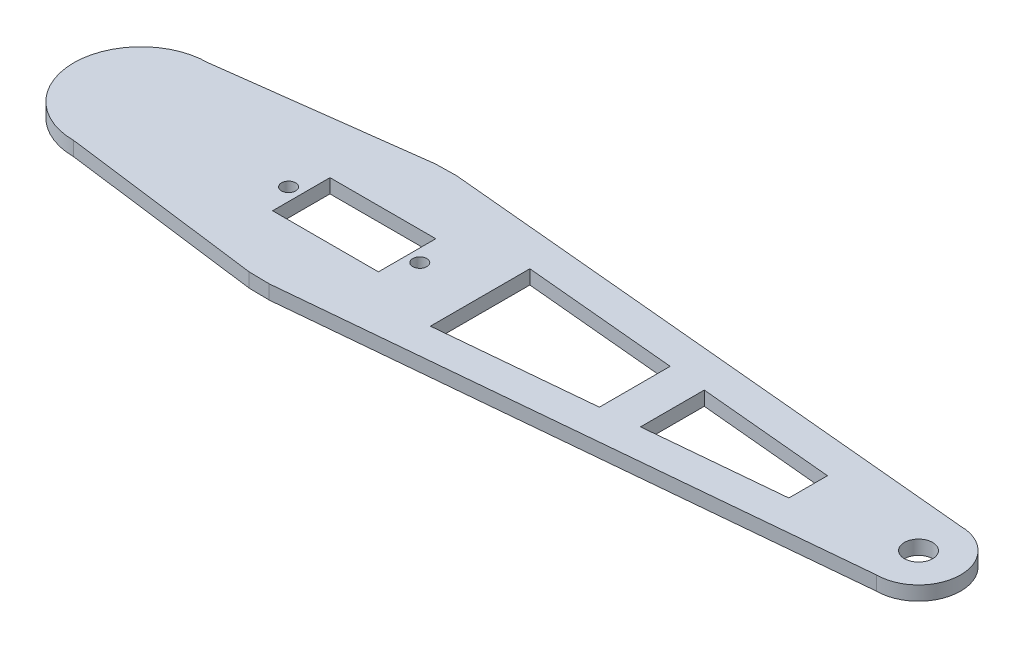
ISO-10303-21;
HEADER;
FILE_DESCRIPTION(('STEP AP214'),'2;1');
FILE_NAME('part.step','',(''),(''),'','','');
FILE_SCHEMA(('AUTOMOTIVE_DESIGN { 1 0 10303 214 1 1 1 1 }'));
ENDSEC;
DATA;
#1=APPLICATION_CONTEXT('core data for automotive mechanical design processes');
#2=APPLICATION_PROTOCOL_DEFINITION('international standard','automotive_design',2000,#1);
#3=PRODUCT_CONTEXT('',#1,'mechanical');
#4=PRODUCT('Part','Part','',(#3));
#5=PRODUCT_RELATED_PRODUCT_CATEGORY('part','',(#4));
#6=PRODUCT_DEFINITION_FORMATION('','',#4);
#7=PRODUCT_DEFINITION_CONTEXT('part definition',#1,'design');
#8=PRODUCT_DEFINITION('design','',#6,#7);
#9=PRODUCT_DEFINITION_SHAPE('','',#8);
#10=(LENGTH_UNIT() NAMED_UNIT(*) SI_UNIT(.MILLI.,.METRE.));
#11=(NAMED_UNIT(*) PLANE_ANGLE_UNIT() SI_UNIT($,.RADIAN.));
#12=(NAMED_UNIT(*) SI_UNIT($,.STERADIAN.) SOLID_ANGLE_UNIT());
#13=UNCERTAINTY_MEASURE_WITH_UNIT(LENGTH_MEASURE(1.E-05),#10,'distance_accuracy_value','');
#14=(GEOMETRIC_REPRESENTATION_CONTEXT(3) GLOBAL_UNCERTAINTY_ASSIGNED_CONTEXT((#13)) GLOBAL_UNIT_ASSIGNED_CONTEXT((#10,
#11,#12)) REPRESENTATION_CONTEXT('',''));
#15=CARTESIAN_POINT('',(0.,0.,0.));
#16=DIRECTION('',(0.,0.,1.));
#17=DIRECTION('',(1.,0.,0.));
#18=AXIS2_PLACEMENT_3D('',#15,#16,#17);
#19=CARTESIAN_POINT('',(120.,3.,0.));
#20=DIRECTION('',(0.,-1.,0.));
#21=DIRECTION('',(0.,0.,-1.));
#22=AXIS2_PLACEMENT_3D('',#19,#20,#21);
#23=PLANE('',#22);
#24=CARTESIAN_POINT('',(-13.95,3.,0.));
#25=DIRECTION('',(0.,1.,0.));
#26=DIRECTION('',(0.,0.,1.));
#27=AXIS2_PLACEMENT_3D('',#24,#25,#26);
#28=CIRCLE('',#27,1.5);
#29=CARTESIAN_POINT('',(-13.95,3.,1.5));
#30=VERTEX_POINT('',#29);
#31=EDGE_CURVE('E213',#30,#30,#28,.T.);
#32=ORIENTED_EDGE('',*,*,#31,.F.);
#33=EDGE_LOOP('',(#32));
#34=FACE_BOUND('',#33,.T.);
#35=CARTESIAN_POINT('',(13.95,3.,0.));
#36=DIRECTION('',(0.,1.,0.));
#37=DIRECTION('',(0.,0.,1.));
#38=AXIS2_PLACEMENT_3D('',#35,#36,#37);
#39=CIRCLE('',#38,1.5);
#40=CARTESIAN_POINT('',(13.95,3.,1.5));
#41=VERTEX_POINT('',#40);
#42=EDGE_CURVE('E219',#41,#41,#39,.T.);
#43=ORIENTED_EDGE('',*,*,#42,.F.);
#44=EDGE_LOOP('',(#43));
#45=FACE_BOUND('',#44,.T.);
#46=DIRECTION('',(0.,0.,-1.));
#47=VECTOR('',#46,1.);
#48=CARTESIAN_POINT('',(96.5291672845656,3.,-4.10426717337135));
#49=LINE('',#48,#47);
#50=CARTESIAN_POINT('',(96.5291672845656,3.,4.10426717337135));
#51=VERTEX_POINT('',#50);
#52=CARTESIAN_POINT('',(96.5291672845656,3.,-4.10426717337135));
#53=VERTEX_POINT('',#52);
#54=EDGE_CURVE('E225',#51,#53,#49,.T.);
#55=ORIENTED_EDGE('',*,*,#54,.F.);
#56=DIRECTION('',(0.9957277620175,0.,-0.0923375543731872));
#57=VECTOR('',#56,1.);
#58=CARTESIAN_POINT('',(96.5291672845656,3.,4.10426717337135));
#59=LINE('',#58,#57);
#60=CARTESIAN_POINT('',(67.6603473994946,3.,6.78138066514184));
#61=VERTEX_POINT('',#60);
#62=EDGE_CURVE('E233',#61,#51,#59,.T.);
#63=ORIENTED_EDGE('',*,*,#62,.F.);
#64=DIRECTION('',(0.,0.,1.));
#65=VECTOR('',#64,1.);
#66=CARTESIAN_POINT('',(67.6603473994946,3.,-6.78138066514184));
#67=LINE('',#66,#65);
#68=CARTESIAN_POINT('',(67.6603473994946,3.,-6.78138066514184));
#69=VERTEX_POINT('',#68);
#70=EDGE_CURVE('E230',#69,#61,#67,.T.);
#71=ORIENTED_EDGE('',*,*,#70,.F.);
#72=DIRECTION('',(-0.9957277620175,0.,-0.092337554373187));
#73=VECTOR('',#72,1.);
#74=CARTESIAN_POINT('',(96.5291672845656,3.,-4.10426717337135));
#75=LINE('',#74,#73);
#76=EDGE_CURVE('E227',#53,#69,#75,.T.);
#77=ORIENTED_EDGE('',*,*,#76,.F.);
#78=EDGE_LOOP('',(#55,#63,#71,#77));
#79=FACE_BOUND('',#78,.T.);
#80=DIRECTION('',(-0.999836383133335,0.,0.018088862950765));
#81=VECTOR('',#80,1.);
#82=CARTESIAN_POINT('',(-2.56588798882,3.,-19.834722554874));
#83=LINE('',#82,#81);
#84=CARTESIAN_POINT('',(1.84675108746374,3.,-19.91455524035));
#85=VERTEX_POINT('',#84);
#86=CARTESIAN_POINT('',(-2.56588798882,3.,-19.834722554874));
#87=VERTEX_POINT('',#86);
#88=EDGE_CURVE('E287',#85,#87,#83,.T.);
#89=ORIENTED_EDGE('',*,*,#88,.T.);
#90=DIRECTION('',(-0.991736127743702,0.,0.128294399441));
#91=VECTOR('',#90,1.);
#92=CARTESIAN_POINT('',(-45.3434905183184,3.,-14.3008646338827));
#93=LINE('',#92,#91);
#94=CARTESIAN_POINT('',(-45.3434905183184,3.,-14.3008646338827));
#95=VERTEX_POINT('',#94);
#96=EDGE_CURVE('E290',#87,#95,#93,.T.);
#97=ORIENTED_EDGE('',*,*,#96,.T.);
#98=CARTESIAN_POINT('',(-45.3434905183184,3.,0.));
#99=DIRECTION('',(0.,1.,0.));
#100=DIRECTION('',(0.,0.,1.));
#101=AXIS2_PLACEMENT_3D('',#98,#99,#100);
#102=CIRCLE('',#101,14.3008646338827);
#103=CARTESIAN_POINT('',(-45.3434905183184,3.,14.3008646338827));
#104=VERTEX_POINT('',#103);
#105=EDGE_CURVE('E293',#95,#104,#102,.T.);
#106=ORIENTED_EDGE('',*,*,#105,.T.);
#107=DIRECTION('',(0.991736127743702,0.,0.128294399441));
#108=VECTOR('',#107,1.);
#109=CARTESIAN_POINT('',(-45.3434905183184,3.,14.3008646338827));
#110=LINE('',#109,#108);
#111=CARTESIAN_POINT('',(-2.56588798882,3.,19.834722554874));
#112=VERTEX_POINT('',#111);
#113=EDGE_CURVE('E295',#104,#112,#110,.T.);
#114=ORIENTED_EDGE('',*,*,#113,.T.);
#115=DIRECTION('',(0.999836383133335,0.,0.0180888629507665));
#116=VECTOR('',#115,1.);
#117=CARTESIAN_POINT('',(-2.56588798882,3.,19.834722554874));
#118=LINE('',#117,#116);
#119=CARTESIAN_POINT('',(1.84675108746374,3.,19.91455524035));
#120=VERTEX_POINT('',#119);
#121=EDGE_CURVE('E297',#112,#120,#118,.T.);
#122=ORIENTED_EDGE('',*,*,#121,.T.);
#123=DIRECTION('',(0.9957277620175,0.,-0.0923375543731872));
#124=VECTOR('',#123,1.);
#125=CARTESIAN_POINT('',(120.,3.,8.95776317127611));
#126=LINE('',#125,#124);
#127=CARTESIAN_POINT('',(120.,3.,8.95776317127611));
#128=VERTEX_POINT('',#127);
#129=EDGE_CURVE('E299',#120,#128,#126,.T.);
#130=ORIENTED_EDGE('',*,*,#129,.T.);
#131=CARTESIAN_POINT('',(120.,3.,0.));
#132=DIRECTION('',(0.,1.,0.));
#133=DIRECTION('',(0.,0.,-1.));
#134=AXIS2_PLACEMENT_3D('',#131,#132,#133);
#135=CIRCLE('',#134,8.95776317127611);
#136=CARTESIAN_POINT('',(120.,3.,-8.95776317127611));
#137=VERTEX_POINT('',#136);
#138=EDGE_CURVE('E301',#128,#137,#135,.T.);
#139=ORIENTED_EDGE('',*,*,#138,.T.);
#140=DIRECTION('',(-0.9957277620175,0.,-0.0923375543731871));
#141=VECTOR('',#140,1.);
#142=CARTESIAN_POINT('',(1.84675108746374,3.,-19.91455524035));
#143=LINE('',#142,#141);
#144=EDGE_CURVE('E303',#137,#85,#143,.T.);
#145=ORIENTED_EDGE('',*,*,#144,.T.);
#146=EDGE_LOOP('',(#89,#97,#106,#114,#122,#130,#139,#145));
#147=FACE_BOUND('',#146,.T.);
#148=DIRECTION('',(0.,0.,-1.));
#149=VECTOR('',#148,1.);
#150=CARTESIAN_POINT('',(11.25,3.,-6.1));
#151=LINE('',#150,#149);
#152=CARTESIAN_POINT('',(11.25,3.,6.1));
#153=VERTEX_POINT('',#152);
#154=CARTESIAN_POINT('',(11.25,3.,-6.1));
#155=VERTEX_POINT('',#154);
#156=EDGE_CURVE('E256',#153,#155,#151,.T.);
#157=ORIENTED_EDGE('',*,*,#156,.F.);
#158=DIRECTION('',(1.,0.,0.));
#159=VECTOR('',#158,1.);
#160=CARTESIAN_POINT('',(-11.25,3.,6.1));
#161=LINE('',#160,#159);
#162=CARTESIAN_POINT('',(-11.25,3.,6.1));
#163=VERTEX_POINT('',#162);
#164=EDGE_CURVE('E264',#163,#153,#161,.T.);
#165=ORIENTED_EDGE('',*,*,#164,.F.);
#166=DIRECTION('',(0.,0.,1.));
#167=VECTOR('',#166,1.);
#168=CARTESIAN_POINT('',(-11.25,3.,-6.1));
#169=LINE('',#168,#167);
#170=CARTESIAN_POINT('',(-11.25,3.,-6.1));
#171=VERTEX_POINT('',#170);
#172=EDGE_CURVE('E261',#171,#163,#169,.T.);
#173=ORIENTED_EDGE('',*,*,#172,.F.);
#174=DIRECTION('',(-1.,0.,0.));
#175=VECTOR('',#174,1.);
#176=CARTESIAN_POINT('',(-11.25,3.,-6.1));
#177=LINE('',#176,#175);
#178=EDGE_CURVE('E258',#155,#171,#177,.T.);
#179=ORIENTED_EDGE('',*,*,#178,.F.);
#180=EDGE_LOOP('',(#157,#165,#173,#179));
#181=FACE_BOUND('',#180,.T.);
#182=DIRECTION('',(0.,0.,-1.));
#183=VECTOR('',#182,1.);
#184=CARTESIAN_POINT('',(59.6591330402502,3.,7.52336315687362));
#185=LINE('',#184,#183);
#186=CARTESIAN_POINT('',(59.6591330402502,3.,7.52336315687362));
#187=VERTEX_POINT('',#186);
#188=CARTESIAN_POINT('',(59.6591330402502,3.,-7.52336315687363));
#189=VERTEX_POINT('',#188);
#190=EDGE_CURVE('E174',#187,#189,#185,.T.);
#191=ORIENTED_EDGE('',*,*,#190,.F.);
#192=DIRECTION('',(0.9957277620175,0.,-0.0923375543731874));
#193=VECTOR('',#192,1.);
#194=CARTESIAN_POINT('',(26.7796007232022,3.,10.5724049923036));
#195=LINE('',#194,#193);
#196=CARTESIAN_POINT('',(26.7796007232022,3.,10.5724049923036));
#197=VERTEX_POINT('',#196);
#198=EDGE_CURVE('E197',#197,#187,#195,.T.);
#199=ORIENTED_EDGE('',*,*,#198,.F.);
#200=DIRECTION('',(0.,0.,1.));
#201=VECTOR('',#200,1.);
#202=CARTESIAN_POINT('',(26.7796007232022,3.,-10.5724049923036));
#203=LINE('',#202,#201);
#204=CARTESIAN_POINT('',(26.7796007232022,3.,-10.5724049923036));
#205=VERTEX_POINT('',#204);
#206=EDGE_CURVE('E195',#205,#197,#203,.T.);
#207=ORIENTED_EDGE('',*,*,#206,.F.);
#208=DIRECTION('',(-0.9957277620175,0.,-0.092337554373187));
#209=VECTOR('',#208,1.);
#210=CARTESIAN_POINT('',(59.6591330402502,3.,-7.52336315687363));
#211=LINE('',#210,#209);
#212=EDGE_CURVE('E182',#189,#205,#211,.T.);
#213=ORIENTED_EDGE('',*,*,#212,.F.);
#214=EDGE_LOOP('',(#191,#199,#207,#213));
#215=FACE_BOUND('',#214,.T.);
#216=CARTESIAN_POINT('',(120.,3.,0.));
#217=DIRECTION('',(0.,1.,0.));
#218=DIRECTION('',(0.,0.,1.));
#219=AXIS2_PLACEMENT_3D('',#216,#217,#218);
#220=CIRCLE('',#219,3.00000000000001);
#221=CARTESIAN_POINT('',(120.,3.,3.00000000000001));
#222=VERTEX_POINT('',#221);
#223=EDGE_CURVE('E203',#222,#222,#220,.T.);
#224=ORIENTED_EDGE('',*,*,#223,.F.);
#225=EDGE_LOOP('',(#224));
#226=FACE_BOUND('',#225,.T.);
#227=ADVANCED_FACE('F37',(#34,#45,#79,#147,#181,#215,#226),#23,.F.);
#228=CARTESIAN_POINT('',(120.,0.,0.));
#229=DIRECTION('',(0.,-1.,0.));
#230=DIRECTION('',(0.,0.,-1.));
#231=AXIS2_PLACEMENT_3D('',#228,#229,#230);
#232=PLANE('',#231);
#233=DIRECTION('',(0.9957277620175,0.,-0.0923375543731874));
#234=VECTOR('',#233,1.);
#235=CARTESIAN_POINT('',(26.7796007232022,0.,10.5724049923036));
#236=LINE('',#235,#234);
#237=CARTESIAN_POINT('',(26.7796007232022,0.,10.5724049923036));
#238=VERTEX_POINT('',#237);
#239=CARTESIAN_POINT('',(59.6591330402502,0.,7.52336315687362));
#240=VERTEX_POINT('',#239);
#241=EDGE_CURVE('E183',#238,#240,#236,.T.);
#242=ORIENTED_EDGE('',*,*,#241,.T.);
#243=DIRECTION('',(0.,0.,-1.));
#244=VECTOR('',#243,1.);
#245=CARTESIAN_POINT('',(59.6591330402502,0.,7.52336315687362));
#246=LINE('',#245,#244);
#247=CARTESIAN_POINT('',(59.6591330402502,0.,-7.52336315687363));
#248=VERTEX_POINT('',#247);
#249=EDGE_CURVE('E60',#240,#248,#246,.T.);
#250=ORIENTED_EDGE('',*,*,#249,.T.);
#251=DIRECTION('',(-0.9957277620175,0.,-0.092337554373187));
#252=VECTOR('',#251,1.);
#253=CARTESIAN_POINT('',(59.6591330402502,0.,-7.52336315687363));
#254=LINE('',#253,#252);
#255=CARTESIAN_POINT('',(26.7796007232022,0.,-10.5724049923036));
#256=VERTEX_POINT('',#255);
#257=EDGE_CURVE('E189',#248,#256,#254,.T.);
#258=ORIENTED_EDGE('',*,*,#257,.T.);
#259=DIRECTION('',(0.,0.,1.));
#260=VECTOR('',#259,1.);
#261=CARTESIAN_POINT('',(26.7796007232022,0.,-10.5724049923036));
#262=LINE('',#261,#260);
#263=EDGE_CURVE('E205',#256,#238,#262,.T.);
#264=ORIENTED_EDGE('',*,*,#263,.T.);
#265=EDGE_LOOP('',(#242,#250,#258,#264));
#266=FACE_BOUND('',#265,.T.);
#267=CARTESIAN_POINT('',(-13.95,0.,0.));
#268=DIRECTION('',(0.,1.,0.));
#269=DIRECTION('',(0.,0.,1.));
#270=AXIS2_PLACEMENT_3D('',#267,#268,#269);
#271=CIRCLE('',#270,1.5);
#272=CARTESIAN_POINT('',(-13.95,0.,1.5));
#273=VERTEX_POINT('',#272);
#274=EDGE_CURVE('E190',#273,#273,#271,.T.);
#275=ORIENTED_EDGE('',*,*,#274,.T.);
#276=EDGE_LOOP('',(#275));
#277=FACE_BOUND('',#276,.T.);
#278=DIRECTION('',(0.9957277620175,0.,-0.0923375543731872));
#279=VECTOR('',#278,1.);
#280=CARTESIAN_POINT('',(96.5291672845656,0.,4.10426717337135));
#281=LINE('',#280,#279);
#282=CARTESIAN_POINT('',(67.6603473994946,0.,6.78138066514184));
#283=VERTEX_POINT('',#282);
#284=CARTESIAN_POINT('',(96.5291672845656,0.,4.10426717337134));
#285=VERTEX_POINT('',#284);
#286=EDGE_CURVE('E228',#283,#285,#281,.T.);
#287=ORIENTED_EDGE('',*,*,#286,.T.);
#288=DIRECTION('',(0.,0.,-1.));
#289=VECTOR('',#288,1.);
#290=CARTESIAN_POINT('',(96.5291672845656,0.,-4.10426717337135));
#291=LINE('',#290,#289);
#292=CARTESIAN_POINT('',(96.5291672845656,0.,-4.10426717337135));
#293=VERTEX_POINT('',#292);
#294=EDGE_CURVE('E222',#285,#293,#291,.T.);
#295=ORIENTED_EDGE('',*,*,#294,.T.);
#296=DIRECTION('',(-0.9957277620175,0.,-0.092337554373187));
#297=VECTOR('',#296,1.);
#298=CARTESIAN_POINT('',(96.5291672845656,0.,-4.10426717337135));
#299=LINE('',#298,#297);
#300=CARTESIAN_POINT('',(67.6603473994946,0.,-6.78138066514184));
#301=VERTEX_POINT('',#300);
#302=EDGE_CURVE('E238',#293,#301,#299,.T.);
#303=ORIENTED_EDGE('',*,*,#302,.T.);
#304=DIRECTION('',(0.,0.,1.));
#305=VECTOR('',#304,1.);
#306=CARTESIAN_POINT('',(67.6603473994946,0.,-6.78138066514184));
#307=LINE('',#306,#305);
#308=EDGE_CURVE('E241',#301,#283,#307,.T.);
#309=ORIENTED_EDGE('',*,*,#308,.T.);
#310=EDGE_LOOP('',(#287,#295,#303,#309));
#311=FACE_BOUND('',#310,.T.);
#312=DIRECTION('',(1.,0.,0.));
#313=VECTOR('',#312,1.);
#314=CARTESIAN_POINT('',(-11.25,0.,6.1));
#315=LINE('',#314,#313);
#316=CARTESIAN_POINT('',(-11.25,0.,6.1));
#317=VERTEX_POINT('',#316);
#318=CARTESIAN_POINT('',(11.25,0.,6.1));
#319=VERTEX_POINT('',#318);
#320=EDGE_CURVE('E259',#317,#319,#315,.T.);
#321=ORIENTED_EDGE('',*,*,#320,.T.);
#322=DIRECTION('',(0.,0.,-1.));
#323=VECTOR('',#322,1.);
#324=CARTESIAN_POINT('',(11.25,0.,-6.1));
#325=LINE('',#324,#323);
#326=CARTESIAN_POINT('',(11.25,0.,-6.1));
#327=VERTEX_POINT('',#326);
#328=EDGE_CURVE('E255',#319,#327,#325,.T.);
#329=ORIENTED_EDGE('',*,*,#328,.T.);
#330=DIRECTION('',(-1.,0.,0.));
#331=VECTOR('',#330,1.);
#332=CARTESIAN_POINT('',(-11.25,0.,-6.1));
#333=LINE('',#332,#331);
#334=CARTESIAN_POINT('',(-11.25,0.,-6.1));
#335=VERTEX_POINT('',#334);
#336=EDGE_CURVE('E269',#327,#335,#333,.T.);
#337=ORIENTED_EDGE('',*,*,#336,.T.);
#338=DIRECTION('',(0.,0.,1.));
#339=VECTOR('',#338,1.);
#340=CARTESIAN_POINT('',(-11.25,0.,-6.1));
#341=LINE('',#340,#339);
#342=EDGE_CURVE('E272',#335,#317,#341,.T.);
#343=ORIENTED_EDGE('',*,*,#342,.T.);
#344=EDGE_LOOP('',(#321,#329,#337,#343));
#345=FACE_BOUND('',#344,.T.);
#346=DIRECTION('',(-0.999836383133335,0.,0.018088862950765));
#347=VECTOR('',#346,1.);
#348=CARTESIAN_POINT('',(-2.56588798882,0.,-19.834722554874));
#349=LINE('',#348,#347);
#350=CARTESIAN_POINT('',(1.84675108746374,0.,-19.91455524035));
#351=VERTEX_POINT('',#350);
#352=CARTESIAN_POINT('',(-2.56588798882,0.,-19.834722554874));
#353=VERTEX_POINT('',#352);
#354=EDGE_CURVE('E286',#351,#353,#349,.T.);
#355=ORIENTED_EDGE('',*,*,#354,.F.);
#356=DIRECTION('',(-0.9957277620175,0.,-0.0923375543731871));
#357=VECTOR('',#356,1.);
#358=CARTESIAN_POINT('',(1.84675108746374,0.,-19.91455524035));
#359=LINE('',#358,#357);
#360=CARTESIAN_POINT('',(120.,0.,-8.95776317127611));
#361=VERTEX_POINT('',#360);
#362=EDGE_CURVE('E291',#361,#351,#359,.T.);
#363=ORIENTED_EDGE('',*,*,#362,.F.);
#364=CARTESIAN_POINT('',(120.,0.,0.));
#365=DIRECTION('',(0.,1.,0.));
#366=DIRECTION('',(0.,0.,-1.));
#367=AXIS2_PLACEMENT_3D('',#364,#365,#366);
#368=CIRCLE('',#367,8.95776317127611);
#369=CARTESIAN_POINT('',(120.,0.,8.95776317127611));
#370=VERTEX_POINT('',#369);
#371=EDGE_CURVE('E318',#370,#361,#368,.T.);
#372=ORIENTED_EDGE('',*,*,#371,.F.);
#373=DIRECTION('',(0.9957277620175,0.,-0.0923375543731872));
#374=VECTOR('',#373,1.);
#375=CARTESIAN_POINT('',(120.,0.,8.95776317127611));
#376=LINE('',#375,#374);
#377=CARTESIAN_POINT('',(1.84675108746374,0.,19.91455524035));
#378=VERTEX_POINT('',#377);
#379=EDGE_CURVE('E316',#378,#370,#376,.T.);
#380=ORIENTED_EDGE('',*,*,#379,.F.);
#381=DIRECTION('',(0.999836383133335,0.,0.0180888629507665));
#382=VECTOR('',#381,1.);
#383=CARTESIAN_POINT('',(-2.56588798882,0.,19.834722554874));
#384=LINE('',#383,#382);
#385=CARTESIAN_POINT('',(-2.56588798882,0.,19.834722554874));
#386=VERTEX_POINT('',#385);
#387=EDGE_CURVE('E314',#386,#378,#384,.T.);
#388=ORIENTED_EDGE('',*,*,#387,.F.);
#389=DIRECTION('',(0.991736127743702,0.,0.128294399441));
#390=VECTOR('',#389,1.);
#391=CARTESIAN_POINT('',(-45.3434905183184,0.,14.3008646338827));
#392=LINE('',#391,#390);
#393=CARTESIAN_POINT('',(-45.3434905183184,0.,14.3008646338827));
#394=VERTEX_POINT('',#393);
#395=EDGE_CURVE('E312',#394,#386,#392,.T.);
#396=ORIENTED_EDGE('',*,*,#395,.F.);
#397=CARTESIAN_POINT('',(-45.3434905183184,0.,0.));
#398=DIRECTION('',(0.,1.,0.));
#399=DIRECTION('',(0.,0.,1.));
#400=AXIS2_PLACEMENT_3D('',#397,#398,#399);
#401=CIRCLE('',#400,14.3008646338827);
#402=CARTESIAN_POINT('',(-45.3434905183184,0.,-14.3008646338827));
#403=VERTEX_POINT('',#402);
#404=EDGE_CURVE('E310',#403,#394,#401,.T.);
#405=ORIENTED_EDGE('',*,*,#404,.F.);
#406=DIRECTION('',(-0.991736127743702,0.,0.128294399441));
#407=VECTOR('',#406,1.);
#408=CARTESIAN_POINT('',(-45.3434905183184,0.,-14.3008646338827));
#409=LINE('',#408,#407);
#410=EDGE_CURVE('E308',#353,#403,#409,.T.);
#411=ORIENTED_EDGE('',*,*,#410,.F.);
#412=EDGE_LOOP('',(#355,#363,#372,#380,#388,#396,#405,#411));
#413=FACE_BOUND('',#412,.T.);
#414=CARTESIAN_POINT('',(13.95,0.,0.));
#415=DIRECTION('',(0.,1.,0.));
#416=DIRECTION('',(0.,0.,1.));
#417=AXIS2_PLACEMENT_3D('',#414,#415,#416);
#418=CIRCLE('',#417,1.5);
#419=CARTESIAN_POINT('',(13.95,0.,1.5));
#420=VERTEX_POINT('',#419);
#421=EDGE_CURVE('E216',#420,#420,#418,.T.);
#422=ORIENTED_EDGE('',*,*,#421,.T.);
#423=EDGE_LOOP('',(#422));
#424=FACE_BOUND('',#423,.T.);
#425=CARTESIAN_POINT('',(120.,0.,0.));
#426=DIRECTION('',(0.,1.,0.));
#427=DIRECTION('',(0.,0.,1.));
#428=AXIS2_PLACEMENT_3D('',#425,#426,#427);
#429=CIRCLE('',#428,3.00000000000001);
#430=CARTESIAN_POINT('',(120.,0.,3.00000000000001));
#431=VERTEX_POINT('',#430);
#432=EDGE_CURVE('E478',#431,#431,#429,.T.);
#433=ORIENTED_EDGE('',*,*,#432,.T.);
#434=EDGE_LOOP('',(#433));
#435=FACE_BOUND('',#434,.T.);
#436=ADVANCED_FACE('F348',(#266,#277,#311,#345,#413,#424,#435),#232,.T.);
#437=CARTESIAN_POINT('',(-2.56588798882,3.,-19.834722554874));
#438=DIRECTION('',(0.018088862950765,0.,0.999836383133335));
#439=DIRECTION('',(0.999836383133335,0.,-0.018088862950765));
#440=AXIS2_PLACEMENT_3D('',#437,#438,#439);
#441=PLANE('',#440);
#442=ORIENTED_EDGE('',*,*,#354,.T.);
#443=DIRECTION('',(0.,-1.,0.));
#444=VECTOR('',#443,1.);
#445=CARTESIAN_POINT('',(-2.56588798882,3.,-19.834722554874));
#446=LINE('',#445,#444);
#447=EDGE_CURVE('E11',#87,#353,#446,.T.);
#448=ORIENTED_EDGE('',*,*,#447,.F.);
#449=ORIENTED_EDGE('',*,*,#88,.F.);
#450=DIRECTION('',(0.,-1.,0.));
#451=VECTOR('',#450,1.);
#452=CARTESIAN_POINT('',(1.84675108746374,3.,-19.91455524035));
#453=LINE('',#452,#451);
#454=EDGE_CURVE('E305',#85,#351,#453,.T.);
#455=ORIENTED_EDGE('',*,*,#454,.T.);
#456=EDGE_LOOP('',(#442,#448,#449,#455));
#457=FACE_BOUND('',#456,.T.);
#458=ADVANCED_FACE('F39',(#457),#441,.F.);
#459=CARTESIAN_POINT('',(-45.3434905183184,3.,-14.3008646338827));
#460=DIRECTION('',(0.128294399441,0.,0.991736127743702));
#461=DIRECTION('',(0.991736127743702,0.,-0.128294399441));
#462=AXIS2_PLACEMENT_3D('',#459,#460,#461);
#463=PLANE('',#462);
#464=ORIENTED_EDGE('',*,*,#410,.T.);
#465=DIRECTION('',(0.,-1.,0.));
#466=VECTOR('',#465,1.);
#467=CARTESIAN_POINT('',(-45.3434905183184,3.,-14.3008646338827));
#468=LINE('',#467,#466);
#469=EDGE_CURVE('E45',#95,#403,#468,.T.);
#470=ORIENTED_EDGE('',*,*,#469,.F.);
#471=ORIENTED_EDGE('',*,*,#96,.F.);
#472=ORIENTED_EDGE('',*,*,#447,.T.);
#473=EDGE_LOOP('',(#464,#470,#471,#472));
#474=FACE_BOUND('',#473,.T.);
#475=ADVANCED_FACE('F366',(#474),#463,.F.);
#476=CARTESIAN_POINT('',(-45.3434905183184,3.,0.));
#477=DIRECTION('',(0.,-1.,0.));
#478=DIRECTION('',(0.,0.,-1.));
#479=AXIS2_PLACEMENT_3D('',#476,#477,#478);
#480=CYLINDRICAL_SURFACE('',#479,14.3008646338827);
#481=ORIENTED_EDGE('',*,*,#404,.T.);
#482=DIRECTION('',(0.,-1.,0.));
#483=VECTOR('',#482,1.);
#484=CARTESIAN_POINT('',(-45.3434905183184,3.,14.3008646338827));
#485=LINE('',#484,#483);
#486=EDGE_CURVE('E335',#104,#394,#485,.T.);
#487=ORIENTED_EDGE('',*,*,#486,.F.);
#488=ORIENTED_EDGE('',*,*,#105,.F.);
#489=ORIENTED_EDGE('',*,*,#469,.T.);
#490=EDGE_LOOP('',(#481,#487,#488,#489));
#491=FACE_BOUND('',#490,.T.);
#492=ADVANCED_FACE('F342',(#491),#480,.T.);
#493=CARTESIAN_POINT('',(-45.3434905183184,3.,14.3008646338827));
#494=DIRECTION('',(0.128294399441,0.,-0.991736127743702));
#495=DIRECTION('',(-0.991736127743702,0.,-0.128294399441));
#496=AXIS2_PLACEMENT_3D('',#493,#494,#495);
#497=PLANE('',#496);
#498=ORIENTED_EDGE('',*,*,#395,.T.);
#499=DIRECTION('',(0.,-1.,0.));
#500=VECTOR('',#499,1.);
#501=CARTESIAN_POINT('',(-2.56588798882,3.,19.834722554874));
#502=LINE('',#501,#500);
#503=EDGE_CURVE('E332',#112,#386,#502,.T.);
#504=ORIENTED_EDGE('',*,*,#503,.F.);
#505=ORIENTED_EDGE('',*,*,#113,.F.);
#506=ORIENTED_EDGE('',*,*,#486,.T.);
#507=EDGE_LOOP('',(#498,#504,#505,#506));
#508=FACE_BOUND('',#507,.T.);
#509=ADVANCED_FACE('F354',(#508),#497,.F.);
#510=CARTESIAN_POINT('',(-2.56588798882,3.,19.834722554874));
#511=DIRECTION('',(0.0180888629507665,0.,-0.999836383133335));
#512=DIRECTION('',(-0.999836383133335,0.,-0.0180888629507665));
#513=AXIS2_PLACEMENT_3D('',#510,#511,#512);
#514=PLANE('',#513);
#515=ORIENTED_EDGE('',*,*,#387,.T.);
#516=DIRECTION('',(0.,-1.,0.));
#517=VECTOR('',#516,1.);
#518=CARTESIAN_POINT('',(1.84675108746374,3.,19.91455524035));
#519=LINE('',#518,#517);
#520=EDGE_CURVE('E329',#120,#378,#519,.T.);
#521=ORIENTED_EDGE('',*,*,#520,.F.);
#522=ORIENTED_EDGE('',*,*,#121,.F.);
#523=ORIENTED_EDGE('',*,*,#503,.T.);
#524=EDGE_LOOP('',(#515,#521,#522,#523));
#525=FACE_BOUND('',#524,.T.);
#526=ADVANCED_FACE('F358',(#525),#514,.F.);
#527=CARTESIAN_POINT('',(120.,3.,8.95776317127611));
#528=DIRECTION('',(-0.0923375543731872,0.,-0.9957277620175));
#529=DIRECTION('',(-0.9957277620175,0.,0.0923375543731872));
#530=AXIS2_PLACEMENT_3D('',#527,#528,#529);
#531=PLANE('',#530);
#532=ORIENTED_EDGE('',*,*,#379,.T.);
#533=DIRECTION('',(0.,-1.,0.));
#534=VECTOR('',#533,1.);
#535=CARTESIAN_POINT('',(120.,3.,8.95776317127611));
#536=LINE('',#535,#534);
#537=EDGE_CURVE('E326',#128,#370,#536,.T.);
#538=ORIENTED_EDGE('',*,*,#537,.F.);
#539=ORIENTED_EDGE('',*,*,#129,.F.);
#540=ORIENTED_EDGE('',*,*,#520,.T.);
#541=EDGE_LOOP('',(#532,#538,#539,#540));
#542=FACE_BOUND('',#541,.T.);
#543=ADVANCED_FACE('F379',(#542),#531,.F.);
#544=CARTESIAN_POINT('',(120.,3.,0.));
#545=DIRECTION('',(0.,-1.,0.));
#546=DIRECTION('',(0.,0.,-1.));
#547=AXIS2_PLACEMENT_3D('',#544,#545,#546);
#548=CYLINDRICAL_SURFACE('',#547,8.95776317127611);
#549=ORIENTED_EDGE('',*,*,#371,.T.);
#550=DIRECTION('',(0.,-1.,0.));
#551=VECTOR('',#550,1.);
#552=CARTESIAN_POINT('',(120.,3.,-8.95776317127611));
#553=LINE('',#552,#551);
#554=EDGE_CURVE('E323',#137,#361,#553,.T.);
#555=ORIENTED_EDGE('',*,*,#554,.F.);
#556=ORIENTED_EDGE('',*,*,#138,.F.);
#557=ORIENTED_EDGE('',*,*,#537,.T.);
#558=EDGE_LOOP('',(#549,#555,#556,#557));
#559=FACE_BOUND('',#558,.T.);
#560=ADVANCED_FACE('F377',(#559),#548,.T.);
#561=CARTESIAN_POINT('',(1.84675108746374,3.,-19.91455524035));
#562=DIRECTION('',(-0.0923375543731871,0.,0.9957277620175));
#563=DIRECTION('',(0.9957277620175,0.,0.0923375543731871));
#564=AXIS2_PLACEMENT_3D('',#561,#562,#563);
#565=PLANE('',#564);
#566=ORIENTED_EDGE('',*,*,#362,.T.);
#567=ORIENTED_EDGE('',*,*,#454,.F.);
#568=ORIENTED_EDGE('',*,*,#144,.F.);
#569=ORIENTED_EDGE('',*,*,#554,.T.);
#570=EDGE_LOOP('',(#566,#567,#568,#569));
#571=FACE_BOUND('',#570,.T.);
#572=ADVANCED_FACE('F372',(#571),#565,.F.);
#573=CARTESIAN_POINT('',(11.25,3.,-6.1));
#574=DIRECTION('',(-1.,0.,0.));
#575=DIRECTION('',(0.,0.,1.));
#576=AXIS2_PLACEMENT_3D('',#573,#574,#575);
#577=PLANE('',#576);
#578=ORIENTED_EDGE('',*,*,#328,.F.);
#579=DIRECTION('',(0.,-1.,0.));
#580=VECTOR('',#579,1.);
#581=CARTESIAN_POINT('',(11.25,3.,6.1));
#582=LINE('',#581,#580);
#583=EDGE_CURVE('E266',#153,#319,#582,.T.);
#584=ORIENTED_EDGE('',*,*,#583,.F.);
#585=ORIENTED_EDGE('',*,*,#156,.T.);
#586=DIRECTION('',(0.,-1.,0.));
#587=VECTOR('',#586,1.);
#588=CARTESIAN_POINT('',(11.25,3.,-6.1));
#589=LINE('',#588,#587);
#590=EDGE_CURVE('E283',#155,#327,#589,.T.);
#591=ORIENTED_EDGE('',*,*,#590,.T.);
#592=EDGE_LOOP('',(#578,#584,#585,#591));
#593=FACE_BOUND('',#592,.T.);
#594=ADVANCED_FACE('F399',(#593),#577,.T.);
#595=CARTESIAN_POINT('',(-11.25,3.,-6.1));
#596=DIRECTION('',(0.,0.,1.));
#597=DIRECTION('',(1.,0.,0.));
#598=AXIS2_PLACEMENT_3D('',#595,#596,#597);
#599=PLANE('',#598);
#600=ORIENTED_EDGE('',*,*,#336,.F.);
#601=ORIENTED_EDGE('',*,*,#590,.F.);
#602=ORIENTED_EDGE('',*,*,#178,.T.);
#603=DIRECTION('',(0.,-1.,0.));
#604=VECTOR('',#603,1.);
#605=CARTESIAN_POINT('',(-11.25,3.,-6.1));
#606=LINE('',#605,#604);
#607=EDGE_CURVE('E281',#171,#335,#606,.T.);
#608=ORIENTED_EDGE('',*,*,#607,.T.);
#609=EDGE_LOOP('',(#600,#601,#602,#608));
#610=FACE_BOUND('',#609,.T.);
#611=ADVANCED_FACE('F406',(#610),#599,.T.);
#612=CARTESIAN_POINT('',(-11.25,3.,-6.1));
#613=DIRECTION('',(1.,0.,0.));
#614=DIRECTION('',(0.,0.,-1.));
#615=AXIS2_PLACEMENT_3D('',#612,#613,#614);
#616=PLANE('',#615);
#617=ORIENTED_EDGE('',*,*,#342,.F.);
#618=ORIENTED_EDGE('',*,*,#607,.F.);
#619=ORIENTED_EDGE('',*,*,#172,.T.);
#620=DIRECTION('',(0.,-1.,0.));
#621=VECTOR('',#620,1.);
#622=CARTESIAN_POINT('',(-11.25,3.,6.1));
#623=LINE('',#622,#621);
#624=EDGE_CURVE('E279',#163,#317,#623,.T.);
#625=ORIENTED_EDGE('',*,*,#624,.T.);
#626=EDGE_LOOP('',(#617,#618,#619,#625));
#627=FACE_BOUND('',#626,.T.);
#628=ADVANCED_FACE('F411',(#627),#616,.T.);
#629=CARTESIAN_POINT('',(-11.25,3.,6.1));
#630=DIRECTION('',(0.,0.,-1.));
#631=DIRECTION('',(-1.,0.,0.));
#632=AXIS2_PLACEMENT_3D('',#629,#630,#631);
#633=PLANE('',#632);
#634=ORIENTED_EDGE('',*,*,#320,.F.);
#635=ORIENTED_EDGE('',*,*,#624,.F.);
#636=ORIENTED_EDGE('',*,*,#164,.T.);
#637=ORIENTED_EDGE('',*,*,#583,.T.);
#638=EDGE_LOOP('',(#634,#635,#636,#637));
#639=FACE_BOUND('',#638,.T.);
#640=ADVANCED_FACE('F419',(#639),#633,.T.);
#641=CARTESIAN_POINT('',(96.5291672845656,3.,-4.10426717337135));
#642=DIRECTION('',(-1.,0.,0.));
#643=DIRECTION('',(0.,0.,1.));
#644=AXIS2_PLACEMENT_3D('',#641,#642,#643);
#645=PLANE('',#644);
#646=ORIENTED_EDGE('',*,*,#294,.F.);
#647=DIRECTION('',(0.,-1.,0.));
#648=VECTOR('',#647,1.);
#649=CARTESIAN_POINT('',(96.5291672845656,3.,4.10426717337135));
#650=LINE('',#649,#648);
#651=EDGE_CURVE('E235',#51,#285,#650,.T.);
#652=ORIENTED_EDGE('',*,*,#651,.F.);
#653=ORIENTED_EDGE('',*,*,#54,.T.);
#654=DIRECTION('',(0.,-1.,0.));
#655=VECTOR('',#654,1.);
#656=CARTESIAN_POINT('',(96.5291672845656,3.,-4.10426717337135));
#657=LINE('',#656,#655);
#658=EDGE_CURVE('E252',#53,#293,#657,.T.);
#659=ORIENTED_EDGE('',*,*,#658,.T.);
#660=EDGE_LOOP('',(#646,#652,#653,#659));
#661=FACE_BOUND('',#660,.T.);
#662=ADVANCED_FACE('F431',(#661),#645,.T.);
#663=CARTESIAN_POINT('',(96.5291672845656,3.,-4.10426717337135));
#664=DIRECTION('',(-0.092337554373187,0.,0.9957277620175));
#665=DIRECTION('',(0.9957277620175,0.,0.092337554373187));
#666=AXIS2_PLACEMENT_3D('',#663,#664,#665);
#667=PLANE('',#666);
#668=ORIENTED_EDGE('',*,*,#302,.F.);
#669=ORIENTED_EDGE('',*,*,#658,.F.);
#670=ORIENTED_EDGE('',*,*,#76,.T.);
#671=DIRECTION('',(0.,-1.,0.));
#672=VECTOR('',#671,1.);
#673=CARTESIAN_POINT('',(67.6603473994946,3.,-6.78138066514184));
#674=LINE('',#673,#672);
#675=EDGE_CURVE('E250',#69,#301,#674,.T.);
#676=ORIENTED_EDGE('',*,*,#675,.T.);
#677=EDGE_LOOP('',(#668,#669,#670,#676));
#678=FACE_BOUND('',#677,.T.);
#679=ADVANCED_FACE('F436',(#678),#667,.T.);
#680=CARTESIAN_POINT('',(67.6603473994946,3.,-6.78138066514184));
#681=DIRECTION('',(1.,0.,0.));
#682=DIRECTION('',(0.,0.,-1.));
#683=AXIS2_PLACEMENT_3D('',#680,#681,#682);
#684=PLANE('',#683);
#685=ORIENTED_EDGE('',*,*,#308,.F.);
#686=ORIENTED_EDGE('',*,*,#675,.F.);
#687=ORIENTED_EDGE('',*,*,#70,.T.);
#688=DIRECTION('',(0.,-1.,0.));
#689=VECTOR('',#688,1.);
#690=CARTESIAN_POINT('',(67.6603473994946,3.,6.78138066514184));
#691=LINE('',#690,#689);
#692=EDGE_CURVE('E248',#61,#283,#691,.T.);
#693=ORIENTED_EDGE('',*,*,#692,.T.);
#694=EDGE_LOOP('',(#685,#686,#687,#693));
#695=FACE_BOUND('',#694,.T.);
#696=ADVANCED_FACE('F440',(#695),#684,.T.);
#697=CARTESIAN_POINT('',(96.5291672845656,3.,4.10426717337135));
#698=DIRECTION('',(-0.0923375543731872,0.,-0.9957277620175));
#699=DIRECTION('',(-0.9957277620175,0.,0.0923375543731872));
#700=AXIS2_PLACEMENT_3D('',#697,#698,#699);
#701=PLANE('',#700);
#702=ORIENTED_EDGE('',*,*,#286,.F.);
#703=ORIENTED_EDGE('',*,*,#692,.F.);
#704=ORIENTED_EDGE('',*,*,#62,.T.);
#705=ORIENTED_EDGE('',*,*,#651,.T.);
#706=EDGE_LOOP('',(#702,#703,#704,#705));
#707=FACE_BOUND('',#706,.T.);
#708=ADVANCED_FACE('F444',(#707),#701,.T.);
#709=CARTESIAN_POINT('',(13.95,3.,0.));
#710=DIRECTION('',(0.,-1.,0.));
#711=DIRECTION('',(0.,0.,-1.));
#712=AXIS2_PLACEMENT_3D('',#709,#710,#711);
#713=CYLINDRICAL_SURFACE('',#712,1.5);
#714=ORIENTED_EDGE('',*,*,#42,.T.);
#715=EDGE_LOOP('',(#714));
#716=FACE_BOUND('',#715,.T.);
#717=ORIENTED_EDGE('',*,*,#421,.F.);
#718=EDGE_LOOP('',(#717));
#719=FACE_BOUND('',#718,.T.);
#720=ADVANCED_FACE('F448',(#716,#719),#713,.F.);
#721=CARTESIAN_POINT('',(-13.95,3.,0.));
#722=DIRECTION('',(0.,-1.,0.));
#723=DIRECTION('',(0.,0.,-1.));
#724=AXIS2_PLACEMENT_3D('',#721,#722,#723);
#725=CYLINDRICAL_SURFACE('',#724,1.5);
#726=ORIENTED_EDGE('',*,*,#31,.T.);
#727=EDGE_LOOP('',(#726));
#728=FACE_BOUND('',#727,.T.);
#729=ORIENTED_EDGE('',*,*,#274,.F.);
#730=EDGE_LOOP('',(#729));
#731=FACE_BOUND('',#730,.T.);
#732=ADVANCED_FACE('F452',(#728,#731),#725,.F.);
#733=CARTESIAN_POINT('',(59.6591330402502,3.,7.52336315687362));
#734=DIRECTION('',(-1.,0.,0.));
#735=DIRECTION('',(0.,0.,1.));
#736=AXIS2_PLACEMENT_3D('',#733,#734,#735);
#737=PLANE('',#736);
#738=ORIENTED_EDGE('',*,*,#249,.F.);
#739=DIRECTION('',(0.,-1.,0.));
#740=VECTOR('',#739,1.);
#741=CARTESIAN_POINT('',(59.6591330402502,3.,7.52336315687362));
#742=LINE('',#741,#740);
#743=EDGE_CURVE('E178',#187,#240,#742,.T.);
#744=ORIENTED_EDGE('',*,*,#743,.F.);
#745=ORIENTED_EDGE('',*,*,#190,.T.);
#746=DIRECTION('',(0.,-1.,0.));
#747=VECTOR('',#746,1.);
#748=CARTESIAN_POINT('',(59.6591330402502,3.,-7.52336315687363));
#749=LINE('',#748,#747);
#750=EDGE_CURVE('E177',#189,#248,#749,.T.);
#751=ORIENTED_EDGE('',*,*,#750,.T.);
#752=EDGE_LOOP('',(#738,#744,#745,#751));
#753=FACE_BOUND('',#752,.T.);
#754=ADVANCED_FACE('F176',(#753),#737,.T.);
#755=CARTESIAN_POINT('',(59.6591330402502,3.,-7.52336315687363));
#756=DIRECTION('',(-0.092337554373187,0.,0.9957277620175));
#757=DIRECTION('',(0.9957277620175,0.,0.092337554373187));
#758=AXIS2_PLACEMENT_3D('',#755,#756,#757);
#759=PLANE('',#758);
#760=ORIENTED_EDGE('',*,*,#257,.F.);
#761=ORIENTED_EDGE('',*,*,#750,.F.);
#762=ORIENTED_EDGE('',*,*,#212,.T.);
#763=DIRECTION('',(0.,-1.,0.));
#764=VECTOR('',#763,1.);
#765=CARTESIAN_POINT('',(26.7796007232022,3.,-10.5724049923036));
#766=LINE('',#765,#764);
#767=EDGE_CURVE('E191',#205,#256,#766,.T.);
#768=ORIENTED_EDGE('',*,*,#767,.T.);
#769=EDGE_LOOP('',(#760,#761,#762,#768));
#770=FACE_BOUND('',#769,.T.);
#771=ADVANCED_FACE('F186',(#770),#759,.T.);
#772=CARTESIAN_POINT('',(26.7796007232022,3.,-10.5724049923036));
#773=DIRECTION('',(1.,0.,0.));
#774=DIRECTION('',(0.,0.,-1.));
#775=AXIS2_PLACEMENT_3D('',#772,#773,#774);
#776=PLANE('',#775);
#777=ORIENTED_EDGE('',*,*,#263,.F.);
#778=ORIENTED_EDGE('',*,*,#767,.F.);
#779=ORIENTED_EDGE('',*,*,#206,.T.);
#780=DIRECTION('',(0.,-1.,0.));
#781=VECTOR('',#780,1.);
#782=CARTESIAN_POINT('',(26.7796007232022,3.,10.5724049923036));
#783=LINE('',#782,#781);
#784=EDGE_CURVE('E52',#197,#238,#783,.T.);
#785=ORIENTED_EDGE('',*,*,#784,.T.);
#786=EDGE_LOOP('',(#777,#778,#779,#785));
#787=FACE_BOUND('',#786,.T.);
#788=ADVANCED_FACE('F461',(#787),#776,.T.);
#789=CARTESIAN_POINT('',(26.7796007232022,3.,10.5724049923036));
#790=DIRECTION('',(-0.0923375543731874,0.,-0.9957277620175));
#791=DIRECTION('',(-0.9957277620175,0.,0.0923375543731874));
#792=AXIS2_PLACEMENT_3D('',#789,#790,#791);
#793=PLANE('',#792);
#794=ORIENTED_EDGE('',*,*,#241,.F.);
#795=ORIENTED_EDGE('',*,*,#784,.F.);
#796=ORIENTED_EDGE('',*,*,#198,.T.);
#797=ORIENTED_EDGE('',*,*,#743,.T.);
#798=EDGE_LOOP('',(#794,#795,#796,#797));
#799=FACE_BOUND('',#798,.T.);
#800=ADVANCED_FACE('F464',(#799),#793,.T.);
#801=CARTESIAN_POINT('',(120.,3.,0.));
#802=DIRECTION('',(0.,-1.,0.));
#803=DIRECTION('',(0.,0.,-1.));
#804=AXIS2_PLACEMENT_3D('',#801,#802,#803);
#805=CYLINDRICAL_SURFACE('',#804,3.00000000000001);
#806=ORIENTED_EDGE('',*,*,#223,.T.);
#807=EDGE_LOOP('',(#806));
#808=FACE_BOUND('',#807,.T.);
#809=ORIENTED_EDGE('',*,*,#432,.F.);
#810=EDGE_LOOP('',(#809));
#811=FACE_BOUND('',#810,.T.);
#812=ADVANCED_FACE('F468',(#808,#811),#805,.F.);
#813=CLOSED_SHELL('',(#227,#436,#458,#475,#492,#509,#526,#543,#560,#572,#594,#611,#628,#640,
#662,#679,#696,#708,#720,#732,#754,#771,#788,#800,#812));
#814=MANIFOLD_SOLID_BREP('B2',#813);
#815=ADVANCED_BREP_SHAPE_REPRESENTATION('',(#18,#814),#14);
#816=SHAPE_DEFINITION_REPRESENTATION(#9,#815);
ENDSEC;
END-ISO-10303-21;
